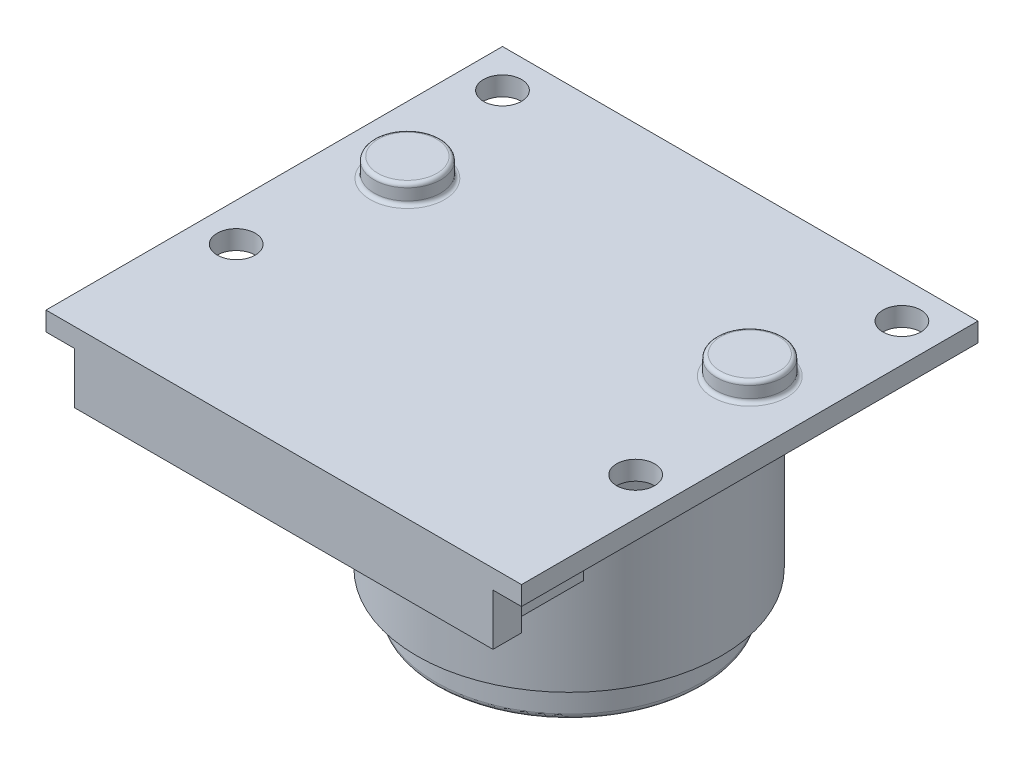
ISO-10303-21;
HEADER;
FILE_DESCRIPTION(('STEP AP214'),'2;1');
FILE_NAME('part.step','',(''),(''),'','','');
FILE_SCHEMA(('AUTOMOTIVE_DESIGN { 1 0 10303 214 1 1 1 1 }'));
ENDSEC;
DATA;
#1=APPLICATION_CONTEXT('core data for automotive mechanical design processes');
#2=APPLICATION_PROTOCOL_DEFINITION('international standard','automotive_design',2000,#1);
#3=PRODUCT_CONTEXT('',#1,'mechanical');
#4=PRODUCT('Part','Part','',(#3));
#5=PRODUCT_RELATED_PRODUCT_CATEGORY('part','',(#4));
#6=PRODUCT_DEFINITION_FORMATION('','',#4);
#7=PRODUCT_DEFINITION_CONTEXT('part definition',#1,'design');
#8=PRODUCT_DEFINITION('design','',#6,#7);
#9=PRODUCT_DEFINITION_SHAPE('','',#8);
#10=(LENGTH_UNIT() NAMED_UNIT(*) SI_UNIT(.MILLI.,.METRE.));
#11=(NAMED_UNIT(*) PLANE_ANGLE_UNIT() SI_UNIT($,.RADIAN.));
#12=(NAMED_UNIT(*) SI_UNIT($,.STERADIAN.) SOLID_ANGLE_UNIT());
#13=UNCERTAINTY_MEASURE_WITH_UNIT(LENGTH_MEASURE(1.E-05),#10,'distance_accuracy_value','');
#14=(GEOMETRIC_REPRESENTATION_CONTEXT(3) GLOBAL_UNCERTAINTY_ASSIGNED_CONTEXT((#13)) GLOBAL_UNIT_ASSIGNED_CONTEXT((#10,
#11,#12)) REPRESENTATION_CONTEXT('',''));
#15=CARTESIAN_POINT('',(0.,0.,0.));
#16=DIRECTION('',(0.,0.,1.));
#17=DIRECTION('',(1.,0.,0.));
#18=AXIS2_PLACEMENT_3D('',#15,#16,#17);
#19=CARTESIAN_POINT('',(0.,1.,0.));
#20=DIRECTION('',(0.,1.,0.));
#21=DIRECTION('',(0.,0.,1.));
#22=AXIS2_PLACEMENT_3D('',#19,#20,#21);
#23=PLANE('',#22);
#24=CARTESIAN_POINT('',(9.,1.,-3.5));
#25=DIRECTION('',(0.,1.,0.));
#26=DIRECTION('',(0.,0.,1.));
#27=AXIS2_PLACEMENT_3D('',#24,#25,#26);
#28=CIRCLE('',#27,1.95);
#29=CARTESIAN_POINT('',(9.,1.,-1.55));
#30=VERTEX_POINT('',#29);
#31=EDGE_CURVE('E216',#30,#30,#28,.F.);
#32=ORIENTED_EDGE('',*,*,#31,.T.);
#33=EDGE_LOOP('',(#32));
#34=FACE_BOUND('',#33,.T.);
#35=CARTESIAN_POINT('',(-9.,1.,-3.5));
#36=DIRECTION('',(0.,1.,0.));
#37=DIRECTION('',(0.,0.,1.));
#38=AXIS2_PLACEMENT_3D('',#35,#36,#37);
#39=CIRCLE('',#38,1.95);
#40=CARTESIAN_POINT('',(-9.,1.,-1.55));
#41=VERTEX_POINT('',#40);
#42=EDGE_CURVE('E219',#41,#41,#39,.F.);
#43=ORIENTED_EDGE('',*,*,#42,.T.);
#44=EDGE_LOOP('',(#43));
#45=FACE_BOUND('',#44,.T.);
#46=CARTESIAN_POINT('',(10.5,1.,4.));
#47=DIRECTION('',(0.,1.,0.));
#48=DIRECTION('',(0.,0.,1.));
#49=AXIS2_PLACEMENT_3D('',#46,#47,#48);
#50=CIRCLE('',#49,1.);
#51=CARTESIAN_POINT('',(10.5,1.,5.));
#52=VERTEX_POINT('',#51);
#53=EDGE_CURVE('E160',#52,#52,#50,.T.);
#54=ORIENTED_EDGE('',*,*,#53,.F.);
#55=EDGE_LOOP('',(#54));
#56=FACE_BOUND('',#55,.T.);
#57=CARTESIAN_POINT('',(-10.5,1.,-10.));
#58=DIRECTION('',(0.,1.,0.));
#59=DIRECTION('',(0.,0.,1.));
#60=AXIS2_PLACEMENT_3D('',#57,#58,#59);
#61=CIRCLE('',#60,0.999999999999999);
#62=CARTESIAN_POINT('',(-10.5,1.,-9.));
#63=VERTEX_POINT('',#62);
#64=EDGE_CURVE('E172',#63,#63,#61,.T.);
#65=ORIENTED_EDGE('',*,*,#64,.F.);
#66=EDGE_LOOP('',(#65));
#67=FACE_BOUND('',#66,.T.);
#68=DIRECTION('',(0.,0.,1.));
#69=VECTOR('',#68,1.);
#70=CARTESIAN_POINT('',(-12.5,1.,12.));
#71=LINE('',#70,#69);
#72=CARTESIAN_POINT('',(-12.5,1.,-12.));
#73=VERTEX_POINT('',#72);
#74=CARTESIAN_POINT('',(-12.5,1.,12.));
#75=VERTEX_POINT('',#74);
#76=EDGE_CURVE('E178',#73,#75,#71,.T.);
#77=ORIENTED_EDGE('',*,*,#76,.T.);
#78=DIRECTION('',(1.,0.,0.));
#79=VECTOR('',#78,1.);
#80=CARTESIAN_POINT('',(12.5,1.,12.));
#81=LINE('',#80,#79);
#82=CARTESIAN_POINT('',(12.5,1.,12.));
#83=VERTEX_POINT('',#82);
#84=EDGE_CURVE('E181',#75,#83,#81,.T.);
#85=ORIENTED_EDGE('',*,*,#84,.T.);
#86=DIRECTION('',(0.,0.,-1.));
#87=VECTOR('',#86,1.);
#88=CARTESIAN_POINT('',(12.5,1.,12.));
#89=LINE('',#88,#87);
#90=CARTESIAN_POINT('',(12.5,1.,-12.));
#91=VERTEX_POINT('',#90);
#92=EDGE_CURVE('E184',#83,#91,#89,.T.);
#93=ORIENTED_EDGE('',*,*,#92,.T.);
#94=DIRECTION('',(-1.,0.,0.));
#95=VECTOR('',#94,1.);
#96=CARTESIAN_POINT('',(12.5,1.,-12.));
#97=LINE('',#96,#95);
#98=EDGE_CURVE('E186',#91,#73,#97,.T.);
#99=ORIENTED_EDGE('',*,*,#98,.T.);
#100=EDGE_LOOP('',(#77,#85,#93,#99));
#101=FACE_BOUND('',#100,.T.);
#102=CARTESIAN_POINT('',(10.5,1.,-10.));
#103=DIRECTION('',(0.,1.,0.));
#104=DIRECTION('',(0.,0.,1.));
#105=AXIS2_PLACEMENT_3D('',#102,#103,#104);
#106=CIRCLE('',#105,1.);
#107=CARTESIAN_POINT('',(10.5,1.,-9.));
#108=VERTEX_POINT('',#107);
#109=EDGE_CURVE('E166',#108,#108,#106,.T.);
#110=ORIENTED_EDGE('',*,*,#109,.F.);
#111=EDGE_LOOP('',(#110));
#112=FACE_BOUND('',#111,.T.);
#113=CARTESIAN_POINT('',(-10.5,1.,4.));
#114=DIRECTION('',(0.,1.,0.));
#115=DIRECTION('',(0.,0.,1.));
#116=AXIS2_PLACEMENT_3D('',#113,#114,#115);
#117=CIRCLE('',#116,1.);
#118=CARTESIAN_POINT('',(-10.5,1.,5.));
#119=VERTEX_POINT('',#118);
#120=EDGE_CURVE('E151',#119,#119,#117,.T.);
#121=ORIENTED_EDGE('',*,*,#120,.F.);
#122=EDGE_LOOP('',(#121));
#123=FACE_BOUND('',#122,.T.);
#124=ADVANCED_FACE('F36',(#34,#45,#56,#67,#101,#112,#123),#23,.T.);
#125=CARTESIAN_POINT('',(0.,0.,0.));
#126=DIRECTION('',(0.,1.,0.));
#127=DIRECTION('',(0.,0.,1.));
#128=AXIS2_PLACEMENT_3D('',#125,#126,#127);
#129=PLANE('',#128);
#130=CARTESIAN_POINT('',(0.,0.,-3.));
#131=DIRECTION('',(0.,1.,0.));
#132=DIRECTION('',(0.,0.,1.));
#133=AXIS2_PLACEMENT_3D('',#130,#131,#132);
#134=CIRCLE('',#133,8.);
#135=CARTESIAN_POINT('',(0.,0.,5.));
#136=VERTEX_POINT('',#135);
#137=EDGE_CURVE('E206',#136,#136,#134,.F.);
#138=ORIENTED_EDGE('',*,*,#137,.F.);
#139=EDGE_LOOP('',(#138));
#140=FACE_BOUND('',#139,.T.);
#141=DIRECTION('',(1.,0.,0.));
#142=VECTOR('',#141,1.);
#143=CARTESIAN_POINT('',(0.,0.,10.5));
#144=LINE('',#143,#142);
#145=CARTESIAN_POINT('',(-11.,0.,10.5));
#146=VERTEX_POINT('',#145);
#147=CARTESIAN_POINT('',(-10.25,0.,10.5));
#148=VERTEX_POINT('',#147);
#149=EDGE_CURVE('E51',#146,#148,#144,.T.);
#150=ORIENTED_EDGE('',*,*,#149,.F.);
#151=DIRECTION('',(0.,0.,1.));
#152=VECTOR('',#151,1.);
#153=CARTESIAN_POINT('',(-11.,0.,0.));
#154=LINE('',#153,#152);
#155=CARTESIAN_POINT('',(-11.,0.,12.));
#156=VERTEX_POINT('',#155);
#157=EDGE_CURVE('E272',#146,#156,#154,.T.);
#158=ORIENTED_EDGE('',*,*,#157,.T.);
#159=DIRECTION('',(1.,0.,0.));
#160=VECTOR('',#159,1.);
#161=CARTESIAN_POINT('',(12.5,0.,12.));
#162=LINE('',#161,#160);
#163=CARTESIAN_POINT('',(-12.5,0.,12.));
#164=VERTEX_POINT('',#163);
#165=EDGE_CURVE('E200',#164,#156,#162,.T.);
#166=ORIENTED_EDGE('',*,*,#165,.F.);
#167=DIRECTION('',(0.,0.,1.));
#168=VECTOR('',#167,1.);
#169=CARTESIAN_POINT('',(-12.5,0.,12.));
#170=LINE('',#169,#168);
#171=CARTESIAN_POINT('',(-12.5,0.,-12.));
#172=VERTEX_POINT('',#171);
#173=EDGE_CURVE('E175',#172,#164,#170,.T.);
#174=ORIENTED_EDGE('',*,*,#173,.F.);
#175=DIRECTION('',(-1.,0.,0.));
#176=VECTOR('',#175,1.);
#177=CARTESIAN_POINT('',(12.5,0.,-12.));
#178=LINE('',#177,#176);
#179=CARTESIAN_POINT('',(12.5,0.,-12.));
#180=VERTEX_POINT('',#179);
#181=EDGE_CURVE('E182',#180,#172,#178,.T.);
#182=ORIENTED_EDGE('',*,*,#181,.F.);
#183=DIRECTION('',(0.,0.,-1.));
#184=VECTOR('',#183,1.);
#185=CARTESIAN_POINT('',(12.5,0.,12.));
#186=LINE('',#185,#184);
#187=CARTESIAN_POINT('',(12.5,0.,12.));
#188=VERTEX_POINT('',#187);
#189=EDGE_CURVE('E194',#188,#180,#186,.T.);
#190=ORIENTED_EDGE('',*,*,#189,.F.);
#191=CARTESIAN_POINT('',(11.,0.,12.));
#192=VERTEX_POINT('',#191);
#193=EDGE_CURVE('E191',#192,#188,#162,.T.);
#194=ORIENTED_EDGE('',*,*,#193,.F.);
#195=DIRECTION('',(0.,0.,1.));
#196=VECTOR('',#195,1.);
#197=CARTESIAN_POINT('',(11.,0.,0.));
#198=LINE('',#197,#196);
#199=CARTESIAN_POINT('',(11.,0.,10.5));
#200=VERTEX_POINT('',#199);
#201=EDGE_CURVE('E265',#200,#192,#198,.T.);
#202=ORIENTED_EDGE('',*,*,#201,.F.);
#203=CARTESIAN_POINT('',(10.25,0.,10.5));
#204=VERTEX_POINT('',#203);
#205=EDGE_CURVE('E273',#204,#200,#144,.T.);
#206=ORIENTED_EDGE('',*,*,#205,.F.);
#207=DIRECTION('',(0.,0.,1.));
#208=VECTOR('',#207,1.);
#209=CARTESIAN_POINT('',(10.25,0.,0.));
#210=LINE('',#209,#208);
#211=CARTESIAN_POINT('',(10.25,0.,6.5));
#212=VERTEX_POINT('',#211);
#213=EDGE_CURVE('E275',#212,#204,#210,.T.);
#214=ORIENTED_EDGE('',*,*,#213,.F.);
#215=DIRECTION('',(1.,0.,0.));
#216=VECTOR('',#215,1.);
#217=CARTESIAN_POINT('',(0.,0.,6.5));
#218=LINE('',#217,#216);
#219=CARTESIAN_POINT('',(-10.25,0.,6.5));
#220=VERTEX_POINT('',#219);
#221=EDGE_CURVE('E147',#220,#212,#218,.T.);
#222=ORIENTED_EDGE('',*,*,#221,.F.);
#223=DIRECTION('',(0.,0.,1.));
#224=VECTOR('',#223,1.);
#225=CARTESIAN_POINT('',(-10.25,0.,0.));
#226=LINE('',#225,#224);
#227=EDGE_CURVE('E56',#220,#148,#226,.T.);
#228=ORIENTED_EDGE('',*,*,#227,.T.);
#229=EDGE_LOOP('',(#150,#158,#166,#174,#182,#190,#194,#202,#206,#214,#222,#228));
#230=FACE_BOUND('',#229,.T.);
#231=CARTESIAN_POINT('',(-10.5,0.,-10.));
#232=DIRECTION('',(0.,1.,0.));
#233=DIRECTION('',(0.,0.,1.));
#234=AXIS2_PLACEMENT_3D('',#231,#232,#233);
#235=CIRCLE('',#234,0.999999999999999);
#236=CARTESIAN_POINT('',(-10.5,0.,-9.));
#237=VERTEX_POINT('',#236);
#238=EDGE_CURVE('E169',#237,#237,#235,.T.);
#239=ORIENTED_EDGE('',*,*,#238,.T.);
#240=EDGE_LOOP('',(#239));
#241=FACE_BOUND('',#240,.T.);
#242=CARTESIAN_POINT('',(10.5,0.,-10.));
#243=DIRECTION('',(0.,1.,0.));
#244=DIRECTION('',(0.,0.,1.));
#245=AXIS2_PLACEMENT_3D('',#242,#243,#244);
#246=CIRCLE('',#245,1.);
#247=CARTESIAN_POINT('',(10.5,0.,-9.));
#248=VERTEX_POINT('',#247);
#249=EDGE_CURVE('E163',#248,#248,#246,.T.);
#250=ORIENTED_EDGE('',*,*,#249,.T.);
#251=EDGE_LOOP('',(#250));
#252=FACE_BOUND('',#251,.T.);
#253=CARTESIAN_POINT('',(10.5,0.,4.));
#254=DIRECTION('',(0.,1.,0.));
#255=DIRECTION('',(0.,0.,1.));
#256=AXIS2_PLACEMENT_3D('',#253,#254,#255);
#257=CIRCLE('',#256,1.);
#258=CARTESIAN_POINT('',(10.5,0.,5.));
#259=VERTEX_POINT('',#258);
#260=EDGE_CURVE('E158',#259,#259,#257,.T.);
#261=ORIENTED_EDGE('',*,*,#260,.T.);
#262=EDGE_LOOP('',(#261));
#263=FACE_BOUND('',#262,.T.);
#264=CARTESIAN_POINT('',(-10.5,0.,4.));
#265=DIRECTION('',(0.,1.,0.));
#266=DIRECTION('',(0.,0.,1.));
#267=AXIS2_PLACEMENT_3D('',#264,#265,#266);
#268=CIRCLE('',#267,1.);
#269=CARTESIAN_POINT('',(-10.5,0.,5.));
#270=VERTEX_POINT('',#269);
#271=EDGE_CURVE('E148',#270,#270,#268,.T.);
#272=ORIENTED_EDGE('',*,*,#271,.T.);
#273=EDGE_LOOP('',(#272));
#274=FACE_BOUND('',#273,.T.);
#275=ADVANCED_FACE('F250',(#140,#230,#241,#252,#263,#274),#129,.F.);
#276=CARTESIAN_POINT('',(-12.5,1.,12.));
#277=DIRECTION('',(1.,0.,0.));
#278=DIRECTION('',(0.,0.,-1.));
#279=AXIS2_PLACEMENT_3D('',#276,#277,#278);
#280=PLANE('',#279);
#281=ORIENTED_EDGE('',*,*,#173,.T.);
#282=DIRECTION('',(0.,-1.,0.));
#283=VECTOR('',#282,1.);
#284=CARTESIAN_POINT('',(-12.5,1.,12.));
#285=LINE('',#284,#283);
#286=EDGE_CURVE('E228',#75,#164,#285,.T.);
#287=ORIENTED_EDGE('',*,*,#286,.F.);
#288=ORIENTED_EDGE('',*,*,#76,.F.);
#289=DIRECTION('',(0.,-1.,0.));
#290=VECTOR('',#289,1.);
#291=CARTESIAN_POINT('',(-12.5,1.,-12.));
#292=LINE('',#291,#290);
#293=EDGE_CURVE('E188',#73,#172,#292,.T.);
#294=ORIENTED_EDGE('',*,*,#293,.T.);
#295=EDGE_LOOP('',(#281,#287,#288,#294));
#296=FACE_BOUND('',#295,.T.);
#297=ADVANCED_FACE('F254',(#296),#280,.F.);
#298=CARTESIAN_POINT('',(12.5,1.,12.));
#299=DIRECTION('',(0.,0.,-1.));
#300=DIRECTION('',(-1.,0.,0.));
#301=AXIS2_PLACEMENT_3D('',#298,#299,#300);
#302=PLANE('',#301);
#303=ORIENTED_EDGE('',*,*,#165,.T.);
#304=DIRECTION('',(0.,1.,0.));
#305=VECTOR('',#304,1.);
#306=CARTESIAN_POINT('',(-11.,-2.7,12.));
#307=LINE('',#306,#305);
#308=CARTESIAN_POINT('',(-11.,-2.7,12.));
#309=VERTEX_POINT('',#308);
#310=EDGE_CURVE('E292',#309,#156,#307,.T.);
#311=ORIENTED_EDGE('',*,*,#310,.F.);
#312=DIRECTION('',(-1.,0.,0.));
#313=VECTOR('',#312,1.);
#314=CARTESIAN_POINT('',(0.,-2.7,12.));
#315=LINE('',#314,#313);
#316=CARTESIAN_POINT('',(11.,-2.7,12.));
#317=VERTEX_POINT('',#316);
#318=EDGE_CURVE('E303',#317,#309,#315,.T.);
#319=ORIENTED_EDGE('',*,*,#318,.F.);
#320=DIRECTION('',(0.,1.,0.));
#321=VECTOR('',#320,1.);
#322=CARTESIAN_POINT('',(11.,-2.7,12.));
#323=LINE('',#322,#321);
#324=EDGE_CURVE('E263',#317,#192,#323,.T.);
#325=ORIENTED_EDGE('',*,*,#324,.T.);
#326=ORIENTED_EDGE('',*,*,#193,.T.);
#327=DIRECTION('',(0.,-1.,0.));
#328=VECTOR('',#327,1.);
#329=CARTESIAN_POINT('',(12.5,1.,12.));
#330=LINE('',#329,#328);
#331=EDGE_CURVE('E231',#83,#188,#330,.T.);
#332=ORIENTED_EDGE('',*,*,#331,.F.);
#333=ORIENTED_EDGE('',*,*,#84,.F.);
#334=ORIENTED_EDGE('',*,*,#286,.T.);
#335=EDGE_LOOP('',(#303,#311,#319,#325,#326,#332,#333,#334));
#336=FACE_BOUND('',#335,.T.);
#337=ADVANCED_FACE('F259',(#336),#302,.F.);
#338=CARTESIAN_POINT('',(12.5,1.,12.));
#339=DIRECTION('',(-1.,0.,0.));
#340=DIRECTION('',(0.,0.,1.));
#341=AXIS2_PLACEMENT_3D('',#338,#339,#340);
#342=PLANE('',#341);
#343=ORIENTED_EDGE('',*,*,#189,.T.);
#344=DIRECTION('',(0.,-1.,0.));
#345=VECTOR('',#344,1.);
#346=CARTESIAN_POINT('',(12.5,1.,-12.));
#347=LINE('',#346,#345);
#348=EDGE_CURVE('E234',#91,#180,#347,.T.);
#349=ORIENTED_EDGE('',*,*,#348,.F.);
#350=ORIENTED_EDGE('',*,*,#92,.F.);
#351=ORIENTED_EDGE('',*,*,#331,.T.);
#352=EDGE_LOOP('',(#343,#349,#350,#351));
#353=FACE_BOUND('',#352,.T.);
#354=ADVANCED_FACE('F244',(#353),#342,.F.);
#355=CARTESIAN_POINT('',(12.5,1.,-12.));
#356=DIRECTION('',(0.,0.,1.));
#357=DIRECTION('',(1.,0.,0.));
#358=AXIS2_PLACEMENT_3D('',#355,#356,#357);
#359=PLANE('',#358);
#360=ORIENTED_EDGE('',*,*,#181,.T.);
#361=ORIENTED_EDGE('',*,*,#293,.F.);
#362=ORIENTED_EDGE('',*,*,#98,.F.);
#363=ORIENTED_EDGE('',*,*,#348,.T.);
#364=EDGE_LOOP('',(#360,#361,#362,#363));
#365=FACE_BOUND('',#364,.T.);
#366=ADVANCED_FACE('F248',(#365),#359,.F.);
#367=CARTESIAN_POINT('',(-10.5,1.,-10.));
#368=DIRECTION('',(0.,-1.,0.));
#369=DIRECTION('',(0.,0.,-1.));
#370=AXIS2_PLACEMENT_3D('',#367,#368,#369);
#371=CYLINDRICAL_SURFACE('',#370,0.999999999999999);
#372=ORIENTED_EDGE('',*,*,#64,.T.);
#373=EDGE_LOOP('',(#372));
#374=FACE_BOUND('',#373,.T.);
#375=ORIENTED_EDGE('',*,*,#238,.F.);
#376=EDGE_LOOP('',(#375));
#377=FACE_BOUND('',#376,.T.);
#378=ADVANCED_FACE('F340',(#374,#377),#371,.F.);
#379=CARTESIAN_POINT('',(10.5,1.,-10.));
#380=DIRECTION('',(0.,-1.,0.));
#381=DIRECTION('',(0.,0.,-1.));
#382=AXIS2_PLACEMENT_3D('',#379,#380,#381);
#383=CYLINDRICAL_SURFACE('',#382,1.);
#384=ORIENTED_EDGE('',*,*,#109,.T.);
#385=EDGE_LOOP('',(#384));
#386=FACE_BOUND('',#385,.T.);
#387=ORIENTED_EDGE('',*,*,#249,.F.);
#388=EDGE_LOOP('',(#387));
#389=FACE_BOUND('',#388,.T.);
#390=ADVANCED_FACE('F395',(#386,#389),#383,.F.);
#391=CARTESIAN_POINT('',(10.5,1.,4.));
#392=DIRECTION('',(0.,-1.,0.));
#393=DIRECTION('',(0.,0.,-1.));
#394=AXIS2_PLACEMENT_3D('',#391,#392,#393);
#395=CYLINDRICAL_SURFACE('',#394,1.);
#396=ORIENTED_EDGE('',*,*,#53,.T.);
#397=EDGE_LOOP('',(#396));
#398=FACE_BOUND('',#397,.T.);
#399=ORIENTED_EDGE('',*,*,#260,.F.);
#400=EDGE_LOOP('',(#399));
#401=FACE_BOUND('',#400,.T.);
#402=ADVANCED_FACE('F392',(#398,#401),#395,.F.);
#403=CARTESIAN_POINT('',(-10.5,1.,4.));
#404=DIRECTION('',(0.,-1.,0.));
#405=DIRECTION('',(0.,0.,-1.));
#406=AXIS2_PLACEMENT_3D('',#403,#404,#405);
#407=CYLINDRICAL_SURFACE('',#406,1.);
#408=ORIENTED_EDGE('',*,*,#120,.T.);
#409=EDGE_LOOP('',(#408));
#410=FACE_BOUND('',#409,.T.);
#411=ORIENTED_EDGE('',*,*,#271,.F.);
#412=EDGE_LOOP('',(#411));
#413=FACE_BOUND('',#412,.T.);
#414=ADVANCED_FACE('F385',(#410,#413),#407,.F.);
#415=CARTESIAN_POINT('',(-9.,2.,-3.5));
#416=DIRECTION('',(0.,-1.,0.));
#417=DIRECTION('',(0.,0.,-1.));
#418=AXIS2_PLACEMENT_3D('',#415,#416,#417);
#419=CYLINDRICAL_SURFACE('',#418,1.75);
#420=CARTESIAN_POINT('',(-9.,1.2,-3.5));
#421=DIRECTION('',(0.,1.,0.));
#422=DIRECTION('',(0.,0.,1.));
#423=AXIS2_PLACEMENT_3D('',#420,#421,#422);
#424=CIRCLE('',#423,1.75);
#425=CARTESIAN_POINT('',(-9.,1.2,-1.75));
#426=VERTEX_POINT('',#425);
#427=EDGE_CURVE('E207',#426,#426,#424,.T.);
#428=ORIENTED_EDGE('',*,*,#427,.T.);
#429=EDGE_LOOP('',(#428));
#430=FACE_BOUND('',#429,.T.);
#431=CARTESIAN_POINT('',(-9.,1.8,-3.5));
#432=DIRECTION('',(0.,1.,0.));
#433=DIRECTION('',(0.,0.,1.));
#434=AXIS2_PLACEMENT_3D('',#431,#432,#433);
#435=CIRCLE('',#434,1.75);
#436=CARTESIAN_POINT('',(-9.,1.8,-1.75));
#437=VERTEX_POINT('',#436);
#438=EDGE_CURVE('E210',#437,#437,#435,.F.);
#439=ORIENTED_EDGE('',*,*,#438,.T.);
#440=EDGE_LOOP('',(#439));
#441=FACE_BOUND('',#440,.T.);
#442=ADVANCED_FACE('F377',(#430,#441),#419,.T.);
#443=CARTESIAN_POINT('',(-9.,2.,-3.5));
#444=DIRECTION('',(0.,1.,0.));
#445=DIRECTION('',(0.,0.,1.));
#446=AXIS2_PLACEMENT_3D('',#443,#444,#445);
#447=PLANE('',#446);
#448=CARTESIAN_POINT('',(-9.,2.,-3.5));
#449=DIRECTION('',(0.,1.,0.));
#450=DIRECTION('',(0.,0.,1.));
#451=AXIS2_PLACEMENT_3D('',#448,#449,#450);
#452=CIRCLE('',#451,1.55);
#453=CARTESIAN_POINT('',(-9.,2.,-1.95));
#454=VERTEX_POINT('',#453);
#455=EDGE_CURVE('E203',#454,#454,#452,.T.);
#456=ORIENTED_EDGE('',*,*,#455,.T.);
#457=EDGE_LOOP('',(#456));
#458=FACE_BOUND('',#457,.T.);
#459=ADVANCED_FACE('F374',(#458),#447,.T.);
#460=CARTESIAN_POINT('',(9.,2.,-3.5));
#461=DIRECTION('',(0.,-1.,0.));
#462=DIRECTION('',(0.,0.,-1.));
#463=AXIS2_PLACEMENT_3D('',#460,#461,#462);
#464=CYLINDRICAL_SURFACE('',#463,1.75);
#465=CARTESIAN_POINT('',(9.,1.2,-3.5));
#466=DIRECTION('',(0.,1.,0.));
#467=DIRECTION('',(0.,0.,1.));
#468=AXIS2_PLACEMENT_3D('',#465,#466,#467);
#469=CIRCLE('',#468,1.75);
#470=CARTESIAN_POINT('',(9.,1.2,-1.75));
#471=VERTEX_POINT('',#470);
#472=EDGE_CURVE('E222',#471,#471,#469,.T.);
#473=ORIENTED_EDGE('',*,*,#472,.T.);
#474=EDGE_LOOP('',(#473));
#475=FACE_BOUND('',#474,.T.);
#476=CARTESIAN_POINT('',(9.,1.8,-3.5));
#477=DIRECTION('',(0.,1.,0.));
#478=DIRECTION('',(0.,0.,1.));
#479=AXIS2_PLACEMENT_3D('',#476,#477,#478);
#480=CIRCLE('',#479,1.75);
#481=CARTESIAN_POINT('',(9.,1.8,-1.75));
#482=VERTEX_POINT('',#481);
#483=EDGE_CURVE('E225',#482,#482,#480,.F.);
#484=ORIENTED_EDGE('',*,*,#483,.T.);
#485=EDGE_LOOP('',(#484));
#486=FACE_BOUND('',#485,.T.);
#487=ADVANCED_FACE('F376',(#475,#486),#464,.T.);
#488=CARTESIAN_POINT('',(9.,2.,-3.5));
#489=DIRECTION('',(0.,1.,0.));
#490=DIRECTION('',(0.,0.,1.));
#491=AXIS2_PLACEMENT_3D('',#488,#489,#490);
#492=PLANE('',#491);
#493=CARTESIAN_POINT('',(9.,2.,-3.5));
#494=DIRECTION('',(0.,1.,0.));
#495=DIRECTION('',(0.,0.,1.));
#496=AXIS2_PLACEMENT_3D('',#493,#494,#495);
#497=CIRCLE('',#496,1.55);
#498=CARTESIAN_POINT('',(9.,2.,-1.95));
#499=VERTEX_POINT('',#498);
#500=EDGE_CURVE('E213',#499,#499,#497,.T.);
#501=ORIENTED_EDGE('',*,*,#500,.T.);
#502=EDGE_LOOP('',(#501));
#503=FACE_BOUND('',#502,.T.);
#504=ADVANCED_FACE('F355',(#503),#492,.T.);
#505=CARTESIAN_POINT('',(9.,1.2,-3.5));
#506=DIRECTION('',(0.,1.,0.));
#507=DIRECTION('',(0.,0.,1.));
#508=AXIS2_PLACEMENT_3D('',#505,#506,#507);
#509=TOROIDAL_SURFACE('',#508,1.95,0.2);
#510=ORIENTED_EDGE('',*,*,#31,.F.);
#511=EDGE_LOOP('',(#510));
#512=FACE_BOUND('',#511,.T.);
#513=ORIENTED_EDGE('',*,*,#472,.F.);
#514=EDGE_LOOP('',(#513));
#515=FACE_BOUND('',#514,.T.);
#516=ADVANCED_FACE('F351',(#512,#515),#509,.F.);
#517=CARTESIAN_POINT('',(9.,1.8,-3.5));
#518=DIRECTION('',(0.,1.,0.));
#519=DIRECTION('',(0.,0.,1.));
#520=AXIS2_PLACEMENT_3D('',#517,#518,#519);
#521=TOROIDAL_SURFACE('',#520,1.55,0.2);
#522=ORIENTED_EDGE('',*,*,#483,.F.);
#523=EDGE_LOOP('',(#522));
#524=FACE_BOUND('',#523,.T.);
#525=ORIENTED_EDGE('',*,*,#500,.F.);
#526=EDGE_LOOP('',(#525));
#527=FACE_BOUND('',#526,.T.);
#528=ADVANCED_FACE('F354',(#524,#527),#521,.T.);
#529=CARTESIAN_POINT('',(-9.,1.2,-3.5));
#530=DIRECTION('',(0.,1.,0.));
#531=DIRECTION('',(0.,0.,1.));
#532=AXIS2_PLACEMENT_3D('',#529,#530,#531);
#533=TOROIDAL_SURFACE('',#532,1.95,0.2);
#534=ORIENTED_EDGE('',*,*,#42,.F.);
#535=EDGE_LOOP('',(#534));
#536=FACE_BOUND('',#535,.T.);
#537=ORIENTED_EDGE('',*,*,#427,.F.);
#538=EDGE_LOOP('',(#537));
#539=FACE_BOUND('',#538,.T.);
#540=ADVANCED_FACE('F359',(#536,#539),#533,.F.);
#541=CARTESIAN_POINT('',(-9.,1.8,-3.5));
#542=DIRECTION('',(0.,1.,0.));
#543=DIRECTION('',(0.,0.,1.));
#544=AXIS2_PLACEMENT_3D('',#541,#542,#543);
#545=TOROIDAL_SURFACE('',#544,1.55,0.2);
#546=ORIENTED_EDGE('',*,*,#438,.F.);
#547=EDGE_LOOP('',(#546));
#548=FACE_BOUND('',#547,.T.);
#549=ORIENTED_EDGE('',*,*,#455,.F.);
#550=EDGE_LOOP('',(#549));
#551=FACE_BOUND('',#550,.T.);
#552=ADVANCED_FACE('F362',(#548,#551),#545,.T.);
#553=CARTESIAN_POINT('',(0.,-2.7,6.5));
#554=DIRECTION('',(0.,0.,1.));
#555=DIRECTION('',(1.,0.,0.));
#556=AXIS2_PLACEMENT_3D('',#553,#554,#555);
#557=PLANE('',#556);
#558=ORIENTED_EDGE('',*,*,#221,.T.);
#559=DIRECTION('',(0.,1.,0.));
#560=VECTOR('',#559,1.);
#561=CARTESIAN_POINT('',(10.25,-2.7,6.5));
#562=LINE('',#561,#560);
#563=CARTESIAN_POINT('',(10.25,-2.7,6.5));
#564=VERTEX_POINT('',#563);
#565=EDGE_CURVE('E129',#564,#212,#562,.T.);
#566=ORIENTED_EDGE('',*,*,#565,.F.);
#567=DIRECTION('',(1.,0.,0.));
#568=VECTOR('',#567,1.);
#569=CARTESIAN_POINT('',(0.,-2.7,6.5));
#570=LINE('',#569,#568);
#571=CARTESIAN_POINT('',(-10.25,-2.7,6.5));
#572=VERTEX_POINT('',#571);
#573=EDGE_CURVE('E136',#572,#564,#570,.T.);
#574=ORIENTED_EDGE('',*,*,#573,.F.);
#575=DIRECTION('',(0.,1.,0.));
#576=VECTOR('',#575,1.);
#577=CARTESIAN_POINT('',(-10.25,-2.7,6.5));
#578=LINE('',#577,#576);
#579=EDGE_CURVE('E287',#572,#220,#578,.T.);
#580=ORIENTED_EDGE('',*,*,#579,.T.);
#581=EDGE_LOOP('',(#558,#566,#574,#580));
#582=FACE_BOUND('',#581,.T.);
#583=ADVANCED_FACE('F146',(#582),#557,.F.);
#584=CARTESIAN_POINT('',(10.25,-2.7,0.));
#585=DIRECTION('',(-1.,0.,0.));
#586=DIRECTION('',(0.,0.,1.));
#587=AXIS2_PLACEMENT_3D('',#584,#585,#586);
#588=PLANE('',#587);
#589=ORIENTED_EDGE('',*,*,#213,.T.);
#590=DIRECTION('',(0.,1.,0.));
#591=VECTOR('',#590,1.);
#592=CARTESIAN_POINT('',(10.25,-2.7,10.5));
#593=LINE('',#592,#591);
#594=CARTESIAN_POINT('',(10.25,-2.7,10.5));
#595=VERTEX_POINT('',#594);
#596=EDGE_CURVE('E132',#595,#204,#593,.T.);
#597=ORIENTED_EDGE('',*,*,#596,.F.);
#598=DIRECTION('',(0.,0.,1.));
#599=VECTOR('',#598,1.);
#600=CARTESIAN_POINT('',(10.25,-2.7,0.));
#601=LINE('',#600,#599);
#602=EDGE_CURVE('E124',#564,#595,#601,.T.);
#603=ORIENTED_EDGE('',*,*,#602,.F.);
#604=ORIENTED_EDGE('',*,*,#565,.T.);
#605=EDGE_LOOP('',(#589,#597,#603,#604));
#606=FACE_BOUND('',#605,.T.);
#607=ADVANCED_FACE('F127',(#606),#588,.F.);
#608=CARTESIAN_POINT('',(0.,-2.7,10.5));
#609=DIRECTION('',(0.,0.,1.));
#610=DIRECTION('',(1.,0.,0.));
#611=AXIS2_PLACEMENT_3D('',#608,#609,#610);
#612=PLANE('',#611);
#613=ORIENTED_EDGE('',*,*,#205,.T.);
#614=DIRECTION('',(0.,1.,0.));
#615=VECTOR('',#614,1.);
#616=CARTESIAN_POINT('',(11.,-2.7,10.5));
#617=LINE('',#616,#615);
#618=CARTESIAN_POINT('',(11.,-2.7,10.5));
#619=VERTEX_POINT('',#618);
#620=EDGE_CURVE('E153',#619,#200,#617,.T.);
#621=ORIENTED_EDGE('',*,*,#620,.F.);
#622=DIRECTION('',(1.,0.,0.));
#623=VECTOR('',#622,1.);
#624=CARTESIAN_POINT('',(0.,-2.7,10.5));
#625=LINE('',#624,#623);
#626=EDGE_CURVE('E135',#595,#619,#625,.T.);
#627=ORIENTED_EDGE('',*,*,#626,.F.);
#628=ORIENTED_EDGE('',*,*,#596,.T.);
#629=EDGE_LOOP('',(#613,#621,#627,#628));
#630=FACE_BOUND('',#629,.T.);
#631=ADVANCED_FACE('F314',(#630),#612,.F.);
#632=CARTESIAN_POINT('',(11.,-2.7,0.));
#633=DIRECTION('',(-1.,0.,0.));
#634=DIRECTION('',(0.,0.,1.));
#635=AXIS2_PLACEMENT_3D('',#632,#633,#634);
#636=PLANE('',#635);
#637=ORIENTED_EDGE('',*,*,#201,.T.);
#638=ORIENTED_EDGE('',*,*,#324,.F.);
#639=DIRECTION('',(0.,0.,1.));
#640=VECTOR('',#639,1.);
#641=CARTESIAN_POINT('',(11.,-2.7,0.));
#642=LINE('',#641,#640);
#643=EDGE_CURVE('E304',#619,#317,#642,.T.);
#644=ORIENTED_EDGE('',*,*,#643,.F.);
#645=ORIENTED_EDGE('',*,*,#620,.T.);
#646=EDGE_LOOP('',(#637,#638,#644,#645));
#647=FACE_BOUND('',#646,.T.);
#648=ADVANCED_FACE('F269',(#647),#636,.F.);
#649=CARTESIAN_POINT('',(-11.,-2.7,0.));
#650=DIRECTION('',(-1.,0.,0.));
#651=DIRECTION('',(0.,0.,1.));
#652=AXIS2_PLACEMENT_3D('',#649,#650,#651);
#653=PLANE('',#652);
#654=ORIENTED_EDGE('',*,*,#157,.F.);
#655=DIRECTION('',(0.,1.,0.));
#656=VECTOR('',#655,1.);
#657=CARTESIAN_POINT('',(-11.,-2.7,10.5));
#658=LINE('',#657,#656);
#659=CARTESIAN_POINT('',(-11.,-2.7,10.5));
#660=VERTEX_POINT('',#659);
#661=EDGE_CURVE('E291',#660,#146,#658,.T.);
#662=ORIENTED_EDGE('',*,*,#661,.F.);
#663=DIRECTION('',(0.,0.,1.));
#664=VECTOR('',#663,1.);
#665=CARTESIAN_POINT('',(-11.,-2.7,0.));
#666=LINE('',#665,#664);
#667=EDGE_CURVE('E302',#660,#309,#666,.T.);
#668=ORIENTED_EDGE('',*,*,#667,.T.);
#669=ORIENTED_EDGE('',*,*,#310,.T.);
#670=EDGE_LOOP('',(#654,#662,#668,#669));
#671=FACE_BOUND('',#670,.T.);
#672=ADVANCED_FACE('F300',(#671),#653,.T.);
#673=ORIENTED_EDGE('',*,*,#149,.T.);
#674=DIRECTION('',(0.,1.,0.));
#675=VECTOR('',#674,1.);
#676=CARTESIAN_POINT('',(-10.25,-2.7,10.5));
#677=LINE('',#676,#675);
#678=CARTESIAN_POINT('',(-10.25,-2.7,10.5));
#679=VERTEX_POINT('',#678);
#680=EDGE_CURVE('E289',#679,#148,#677,.T.);
#681=ORIENTED_EDGE('',*,*,#680,.F.);
#682=EDGE_CURVE('E306',#660,#679,#625,.T.);
#683=ORIENTED_EDGE('',*,*,#682,.F.);
#684=ORIENTED_EDGE('',*,*,#661,.T.);
#685=EDGE_LOOP('',(#673,#681,#683,#684));
#686=FACE_BOUND('',#685,.T.);
#687=ADVANCED_FACE('F318',(#686),#612,.F.);
#688=CARTESIAN_POINT('',(-10.25,-2.7,0.));
#689=DIRECTION('',(-1.,0.,0.));
#690=DIRECTION('',(0.,0.,1.));
#691=AXIS2_PLACEMENT_3D('',#688,#689,#690);
#692=PLANE('',#691);
#693=ORIENTED_EDGE('',*,*,#227,.F.);
#694=ORIENTED_EDGE('',*,*,#579,.F.);
#695=DIRECTION('',(0.,0.,1.));
#696=VECTOR('',#695,1.);
#697=CARTESIAN_POINT('',(-10.25,-2.7,0.));
#698=LINE('',#697,#696);
#699=EDGE_CURVE('E142',#572,#679,#698,.T.);
#700=ORIENTED_EDGE('',*,*,#699,.T.);
#701=ORIENTED_EDGE('',*,*,#680,.T.);
#702=EDGE_LOOP('',(#693,#694,#700,#701));
#703=FACE_BOUND('',#702,.T.);
#704=ADVANCED_FACE('F320',(#703),#692,.T.);
#705=CARTESIAN_POINT('',(0.,-2.7,0.));
#706=DIRECTION('',(0.,-1.,0.));
#707=DIRECTION('',(0.,0.,-1.));
#708=AXIS2_PLACEMENT_3D('',#705,#706,#707);
#709=PLANE('',#708);
#710=ORIENTED_EDGE('',*,*,#573,.T.);
#711=ORIENTED_EDGE('',*,*,#602,.T.);
#712=ORIENTED_EDGE('',*,*,#626,.T.);
#713=ORIENTED_EDGE('',*,*,#643,.T.);
#714=ORIENTED_EDGE('',*,*,#318,.T.);
#715=ORIENTED_EDGE('',*,*,#667,.F.);
#716=ORIENTED_EDGE('',*,*,#682,.T.);
#717=ORIENTED_EDGE('',*,*,#699,.F.);
#718=EDGE_LOOP('',(#710,#711,#712,#713,#714,#715,#716,#717));
#719=FACE_BOUND('',#718,.T.);
#720=ADVANCED_FACE('F140',(#719),#709,.T.);
#721=CARTESIAN_POINT('',(0.,-12.,-3.));
#722=DIRECTION('',(0.,1.,0.));
#723=DIRECTION('',(0.,0.,1.));
#724=AXIS2_PLACEMENT_3D('',#721,#722,#723);
#725=CYLINDRICAL_SURFACE('',#724,8.);
#726=CARTESIAN_POINT('',(0.,-12.,-3.));
#727=DIRECTION('',(0.,-1.,0.));
#728=DIRECTION('',(0.,0.,-1.));
#729=AXIS2_PLACEMENT_3D('',#726,#727,#728);
#730=CIRCLE('',#729,8.);
#731=CARTESIAN_POINT('',(0.,-12.,-11.));
#732=VERTEX_POINT('',#731);
#733=EDGE_CURVE('E312',#732,#732,#730,.T.);
#734=ORIENTED_EDGE('',*,*,#733,.F.);
#735=EDGE_LOOP('',(#734));
#736=FACE_BOUND('',#735,.T.);
#737=ORIENTED_EDGE('',*,*,#137,.T.);
#738=EDGE_LOOP('',(#737));
#739=FACE_BOUND('',#738,.T.);
#740=ADVANCED_FACE('F327',(#736,#739),#725,.T.);
#741=CARTESIAN_POINT('',(0.,-12.,-3.));
#742=DIRECTION('',(0.,-1.,0.));
#743=DIRECTION('',(0.,0.,-1.));
#744=AXIS2_PLACEMENT_3D('',#741,#742,#743);
#745=PLANE('',#744);
#746=CARTESIAN_POINT('',(0.,-12.,-3.));
#747=DIRECTION('',(0.,-1.,0.));
#748=DIRECTION('',(0.,0.,-1.));
#749=AXIS2_PLACEMENT_3D('',#746,#747,#748);
#750=CIRCLE('',#749,7.);
#751=CARTESIAN_POINT('',(0.,-12.,-10.));
#752=VERTEX_POINT('',#751);
#753=EDGE_CURVE('E509',#752,#752,#750,.T.);
#754=ORIENTED_EDGE('',*,*,#753,.F.);
#755=EDGE_LOOP('',(#754));
#756=FACE_BOUND('',#755,.T.);
#757=ORIENTED_EDGE('',*,*,#733,.T.);
#758=EDGE_LOOP('',(#757));
#759=FACE_BOUND('',#758,.T.);
#760=ADVANCED_FACE('F455',(#756,#759),#745,.T.);
#761=CARTESIAN_POINT('',(0.,-14.,-3.));
#762=DIRECTION('',(0.,1.,0.));
#763=DIRECTION('',(0.,0.,1.));
#764=AXIS2_PLACEMENT_3D('',#761,#762,#763);
#765=CYLINDRICAL_SURFACE('',#764,7.);
#766=CARTESIAN_POINT('',(0.,-13.7,-3.));
#767=DIRECTION('',(0.,-1.,0.));
#768=DIRECTION('',(0.,0.,-1.));
#769=AXIS2_PLACEMENT_3D('',#766,#767,#768);
#770=CIRCLE('',#769,7.);
#771=CARTESIAN_POINT('',(0.,-13.7,-10.));
#772=VERTEX_POINT('',#771);
#773=EDGE_CURVE('E11',#772,#772,#770,.F.);
#774=ORIENTED_EDGE('',*,*,#773,.T.);
#775=EDGE_LOOP('',(#774));
#776=FACE_BOUND('',#775,.T.);
#777=ORIENTED_EDGE('',*,*,#753,.T.);
#778=EDGE_LOOP('',(#777));
#779=FACE_BOUND('',#778,.T.);
#780=ADVANCED_FACE('F465',(#776,#779),#765,.T.);
#781=CARTESIAN_POINT('',(0.,-14.,-3.));
#782=DIRECTION('',(0.,-1.,0.));
#783=DIRECTION('',(0.,0.,-1.));
#784=AXIS2_PLACEMENT_3D('',#781,#782,#783);
#785=PLANE('',#784);
#786=CARTESIAN_POINT('',(0.,-14.,-3.));
#787=DIRECTION('',(0.,-1.,0.));
#788=DIRECTION('',(0.,0.,-1.));
#789=AXIS2_PLACEMENT_3D('',#786,#787,#788);
#790=CIRCLE('',#789,6.7);
#791=CARTESIAN_POINT('',(0.,-14.,-9.7));
#792=VERTEX_POINT('',#791);
#793=EDGE_CURVE('E44',#792,#792,#790,.T.);
#794=ORIENTED_EDGE('',*,*,#793,.T.);
#795=EDGE_LOOP('',(#794));
#796=FACE_BOUND('',#795,.T.);
#797=ADVANCED_FACE('F475',(#796),#785,.T.);
#798=CARTESIAN_POINT('',(0.,-13.7,-3.));
#799=DIRECTION('',(0.,-1.,0.));
#800=DIRECTION('',(0.,0.,-1.));
#801=AXIS2_PLACEMENT_3D('',#798,#799,#800);
#802=TOROIDAL_SURFACE('',#801,6.7,0.3);
#803=ORIENTED_EDGE('',*,*,#773,.F.);
#804=EDGE_LOOP('',(#803));
#805=FACE_BOUND('',#804,.T.);
#806=ORIENTED_EDGE('',*,*,#793,.F.);
#807=EDGE_LOOP('',(#806));
#808=FACE_BOUND('',#807,.T.);
#809=ADVANCED_FACE('F38',(#805,#808),#802,.T.);
#810=CLOSED_SHELL('',(#124,#275,#297,#337,#354,#366,#378,#390,#402,#414,#442,#459,#487,#504,
#516,#528,#540,#552,#583,#607,#631,#648,#672,#687,#704,#720,#740,#760,#780,#797,#809));
#811=MANIFOLD_SOLID_BREP('B2',#810);
#812=ADVANCED_BREP_SHAPE_REPRESENTATION('',(#18,#811),#14);
#813=SHAPE_DEFINITION_REPRESENTATION(#9,#812);
ENDSEC;
END-ISO-10303-21;
